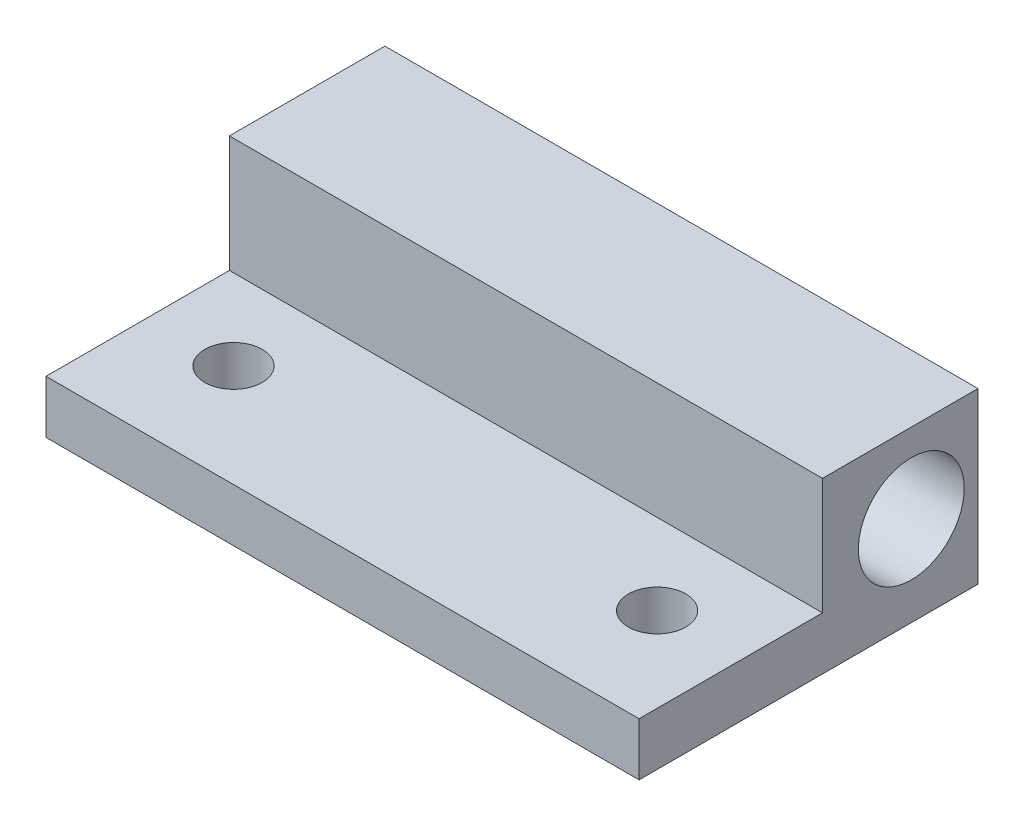
ISO-10303-21;
HEADER;
FILE_DESCRIPTION(('STEP AP214'),'2;1');
FILE_NAME('part.step','',(''),(''),'','','');
FILE_SCHEMA(('AUTOMOTIVE_DESIGN { 1 0 10303 214 1 1 1 1 }'));
ENDSEC;
DATA;
#1=APPLICATION_CONTEXT('core data for automotive mechanical design processes');
#2=APPLICATION_PROTOCOL_DEFINITION('international standard','automotive_design',2000,#1);
#3=PRODUCT_CONTEXT('',#1,'mechanical');
#4=PRODUCT('Part','Part','',(#3));
#5=PRODUCT_RELATED_PRODUCT_CATEGORY('part','',(#4));
#6=PRODUCT_DEFINITION_FORMATION('','',#4);
#7=PRODUCT_DEFINITION_CONTEXT('part definition',#1,'design');
#8=PRODUCT_DEFINITION('design','',#6,#7);
#9=PRODUCT_DEFINITION_SHAPE('','',#8);
#10=(LENGTH_UNIT() NAMED_UNIT(*) SI_UNIT(.MILLI.,.METRE.));
#11=(NAMED_UNIT(*) PLANE_ANGLE_UNIT() SI_UNIT($,.RADIAN.));
#12=(NAMED_UNIT(*) SI_UNIT($,.STERADIAN.) SOLID_ANGLE_UNIT());
#13=UNCERTAINTY_MEASURE_WITH_UNIT(LENGTH_MEASURE(1.E-05),#10,'distance_accuracy_value','');
#14=(GEOMETRIC_REPRESENTATION_CONTEXT(3) GLOBAL_UNCERTAINTY_ASSIGNED_CONTEXT((#13)) GLOBAL_UNIT_ASSIGNED_CONTEXT((#10,
#11,#12)) REPRESENTATION_CONTEXT('',''));
#15=CARTESIAN_POINT('',(0.,0.,0.));
#16=DIRECTION('',(0.,0.,1.));
#17=DIRECTION('',(1.,0.,0.));
#18=AXIS2_PLACEMENT_3D('',#15,#16,#17);
#19=CARTESIAN_POINT('',(-56.695243637364,12.7,44.9425829211284));
#20=DIRECTION('',(0.,0.,-1.));
#21=DIRECTION('',(-1.,0.,0.));
#22=AXIS2_PLACEMENT_3D('',#19,#20,#21);
#23=PLANE('',#22);
#24=DIRECTION('',(1.,0.,0.));
#25=VECTOR('',#24,1.);
#26=CARTESIAN_POINT('',(-12.245243637364,3.96875,44.9425829211284));
#27=LINE('',#26,#25);
#28=CARTESIAN_POINT('',(-56.695243637364,3.96875,44.9425829211284));
#29=VERTEX_POINT('',#28);
#30=CARTESIAN_POINT('',(-12.245243637364,3.96875,44.9425829211284));
#31=VERTEX_POINT('',#30);
#32=EDGE_CURVE('E121',#29,#31,#27,.T.);
#33=ORIENTED_EDGE('',*,*,#32,.F.);
#34=DIRECTION('',(0.,-1.,0.));
#35=VECTOR('',#34,1.);
#36=CARTESIAN_POINT('',(-56.695243637364,12.7,44.9425829211284));
#37=LINE('',#36,#35);
#38=CARTESIAN_POINT('',(-56.695243637364,0.,44.9425829211284));
#39=VERTEX_POINT('',#38);
#40=EDGE_CURVE('E11',#29,#39,#37,.T.);
#41=ORIENTED_EDGE('',*,*,#40,.T.);
#42=DIRECTION('',(1.,0.,0.));
#43=VECTOR('',#42,1.);
#44=CARTESIAN_POINT('',(-56.695243637364,0.,44.9425829211284));
#45=LINE('',#44,#43);
#46=CARTESIAN_POINT('',(-12.245243637364,0.,44.9425829211284));
#47=VERTEX_POINT('',#46);
#48=EDGE_CURVE('E98',#39,#47,#45,.T.);
#49=ORIENTED_EDGE('',*,*,#48,.T.);
#50=DIRECTION('',(0.,-1.,0.));
#51=VECTOR('',#50,1.);
#52=CARTESIAN_POINT('',(-12.245243637364,12.7,44.9425829211284));
#53=LINE('',#52,#51);
#54=EDGE_CURVE('E41',#31,#47,#53,.T.);
#55=ORIENTED_EDGE('',*,*,#54,.F.);
#56=EDGE_LOOP('',(#33,#41,#49,#55));
#57=FACE_BOUND('',#56,.T.);
#58=ADVANCED_FACE('F32',(#57),#23,.F.);
#59=CARTESIAN_POINT('',(-18.595243637364,12.7,37.2435104576501));
#60=DIRECTION('',(0.,1.,0.));
#61=DIRECTION('',(0.,0.,1.));
#62=AXIS2_PLACEMENT_3D('',#59,#60,#61);
#63=CYLINDRICAL_SURFACE('',#62,2.15264999999999);
#64=CARTESIAN_POINT('',(-18.595243637364,0.,37.2435104576501));
#65=DIRECTION('',(0.,1.,0.));
#66=DIRECTION('',(0.,0.,1.));
#67=AXIS2_PLACEMENT_3D('',#64,#65,#66);
#68=CIRCLE('',#67,2.15264999999999);
#69=CARTESIAN_POINT('',(-18.595243637364,0.,39.3961604576501));
#70=VERTEX_POINT('',#69);
#71=EDGE_CURVE('E154',#70,#70,#68,.T.);
#72=ORIENTED_EDGE('',*,*,#71,.F.);
#73=EDGE_LOOP('',(#72));
#74=FACE_BOUND('',#73,.T.);
#75=CARTESIAN_POINT('',(-18.595243637364,3.96875,37.2435104576501));
#76=DIRECTION('',(0.,1.,0.));
#77=DIRECTION('',(0.,0.,1.));
#78=AXIS2_PLACEMENT_3D('',#75,#76,#77);
#79=CIRCLE('',#78,2.15264999999999);
#80=CARTESIAN_POINT('',(-18.595243637364,3.96875,39.3961604576501));
#81=VERTEX_POINT('',#80);
#82=EDGE_CURVE('E148',#81,#81,#79,.F.);
#83=ORIENTED_EDGE('',*,*,#82,.F.);
#84=EDGE_LOOP('',(#83));
#85=FACE_BOUND('',#84,.T.);
#86=ADVANCED_FACE('F173',(#74,#85),#63,.F.);
#87=CARTESIAN_POINT('',(-50.345243637364,12.7,37.2435104576501));
#88=DIRECTION('',(0.,1.,0.));
#89=DIRECTION('',(0.,0.,1.));
#90=AXIS2_PLACEMENT_3D('',#87,#88,#89);
#91=CYLINDRICAL_SURFACE('',#90,2.15265);
#92=CARTESIAN_POINT('',(-50.345243637364,0.,37.2435104576501));
#93=DIRECTION('',(0.,1.,0.));
#94=DIRECTION('',(0.,0.,1.));
#95=AXIS2_PLACEMENT_3D('',#92,#93,#94);
#96=CIRCLE('',#95,2.15265);
#97=CARTESIAN_POINT('',(-50.345243637364,0.,39.3961604576501));
#98=VERTEX_POINT('',#97);
#99=EDGE_CURVE('E151',#98,#98,#96,.T.);
#100=ORIENTED_EDGE('',*,*,#99,.F.);
#101=EDGE_LOOP('',(#100));
#102=FACE_BOUND('',#101,.T.);
#103=CARTESIAN_POINT('',(-50.345243637364,3.96875,37.2435104576501));
#104=DIRECTION('',(0.,1.,0.));
#105=DIRECTION('',(0.,0.,1.));
#106=AXIS2_PLACEMENT_3D('',#103,#104,#105);
#107=CIRCLE('',#106,2.15265);
#108=CARTESIAN_POINT('',(-50.345243637364,3.96875,39.3961604576501));
#109=VERTEX_POINT('',#108);
#110=EDGE_CURVE('E36',#109,#109,#107,.F.);
#111=ORIENTED_EDGE('',*,*,#110,.F.);
#112=EDGE_LOOP('',(#111));
#113=FACE_BOUND('',#112,.T.);
#114=ADVANCED_FACE('F177',(#102,#113),#91,.F.);
#115=CARTESIAN_POINT('',(-56.695243637364,12.7,19.5425829211284));
#116=DIRECTION('',(1.,0.,0.));
#117=DIRECTION('',(0.,0.,-1.));
#118=AXIS2_PLACEMENT_3D('',#115,#116,#117);
#119=PLANE('',#118);
#120=CARTESIAN_POINT('',(-56.695243637364,6.746875,24.5435104576501));
#121=DIRECTION('',(1.,0.,0.));
#122=DIRECTION('',(0.,0.,-1.));
#123=AXIS2_PLACEMENT_3D('',#120,#121,#122);
#124=CIRCLE('',#123,3.96875);
#125=CARTESIAN_POINT('',(-56.695243637364,6.746875,20.5747604576501));
#126=VERTEX_POINT('',#125);
#127=EDGE_CURVE('E99',#126,#126,#124,.F.);
#128=ORIENTED_EDGE('',*,*,#127,.F.);
#129=EDGE_LOOP('',(#128));
#130=FACE_BOUND('',#129,.T.);
#131=DIRECTION('',(0.,0.,1.));
#132=VECTOR('',#131,1.);
#133=CARTESIAN_POINT('',(-56.695243637364,3.96875,44.9425829211284));
#134=LINE('',#133,#132);
#135=CARTESIAN_POINT('',(-56.695243637364,3.96875,31.1971095114956));
#136=VERTEX_POINT('',#135);
#137=EDGE_CURVE('E124',#136,#29,#134,.T.);
#138=ORIENTED_EDGE('',*,*,#137,.F.);
#139=DIRECTION('',(0.,1.,0.));
#140=VECTOR('',#139,1.);
#141=CARTESIAN_POINT('',(-56.695243637364,3.96875,31.1971095114956));
#142=LINE('',#141,#140);
#143=CARTESIAN_POINT('',(-56.695243637364,12.7,31.1971095114956));
#144=VERTEX_POINT('',#143);
#145=EDGE_CURVE('E137',#136,#144,#142,.T.);
#146=ORIENTED_EDGE('',*,*,#145,.T.);
#147=DIRECTION('',(0.,0.,1.));
#148=VECTOR('',#147,1.);
#149=CARTESIAN_POINT('',(-56.695243637364,12.7,19.5425829211284));
#150=LINE('',#149,#148);
#151=CARTESIAN_POINT('',(-56.695243637364,12.7,19.5425829211284));
#152=VERTEX_POINT('',#151);
#153=EDGE_CURVE('E85',#152,#144,#150,.T.);
#154=ORIENTED_EDGE('',*,*,#153,.F.);
#155=DIRECTION('',(0.,-1.,0.));
#156=VECTOR('',#155,1.);
#157=CARTESIAN_POINT('',(-56.695243637364,12.7,19.5425829211284));
#158=LINE('',#157,#156);
#159=CARTESIAN_POINT('',(-56.695243637364,0.,19.5425829211284));
#160=VERTEX_POINT('',#159);
#161=EDGE_CURVE('E78',#152,#160,#158,.T.);
#162=ORIENTED_EDGE('',*,*,#161,.T.);
#163=DIRECTION('',(0.,0.,1.));
#164=VECTOR('',#163,1.);
#165=CARTESIAN_POINT('',(-56.695243637364,0.,19.5425829211284));
#166=LINE('',#165,#164);
#167=EDGE_CURVE('E92',#160,#39,#166,.T.);
#168=ORIENTED_EDGE('',*,*,#167,.T.);
#169=ORIENTED_EDGE('',*,*,#40,.F.);
#170=EDGE_LOOP('',(#138,#146,#154,#162,#168,#169));
#171=FACE_BOUND('',#170,.T.);
#172=ADVANCED_FACE('F34',(#130,#171),#119,.F.);
#173=CARTESIAN_POINT('',(-12.245243637364,12.7,19.5425829211284));
#174=DIRECTION('',(-1.,0.,0.));
#175=DIRECTION('',(0.,0.,1.));
#176=AXIS2_PLACEMENT_3D('',#173,#174,#175);
#177=PLANE('',#176);
#178=CARTESIAN_POINT('',(-12.245243637364,6.746875,24.5435104576501));
#179=DIRECTION('',(1.,0.,0.));
#180=DIRECTION('',(0.,0.,-1.));
#181=AXIS2_PLACEMENT_3D('',#178,#179,#180);
#182=CIRCLE('',#181,3.96875);
#183=CARTESIAN_POINT('',(-12.245243637364,6.746875,20.5747604576501));
#184=VERTEX_POINT('',#183);
#185=EDGE_CURVE('E103',#184,#184,#182,.T.);
#186=ORIENTED_EDGE('',*,*,#185,.F.);
#187=EDGE_LOOP('',(#186));
#188=FACE_BOUND('',#187,.T.);
#189=DIRECTION('',(0.,0.,-1.));
#190=VECTOR('',#189,1.);
#191=CARTESIAN_POINT('',(-12.245243637364,12.7,19.5425829211284));
#192=LINE('',#191,#190);
#193=CARTESIAN_POINT('',(-12.245243637364,12.7,31.1971095114956));
#194=VERTEX_POINT('',#193);
#195=CARTESIAN_POINT('',(-12.245243637364,12.7,19.5425829211284));
#196=VERTEX_POINT('',#195);
#197=EDGE_CURVE('E142',#194,#196,#192,.T.);
#198=ORIENTED_EDGE('',*,*,#197,.F.);
#199=DIRECTION('',(0.,1.,0.));
#200=VECTOR('',#199,1.);
#201=CARTESIAN_POINT('',(-12.245243637364,3.96875,31.1971095114956));
#202=LINE('',#201,#200);
#203=CARTESIAN_POINT('',(-12.245243637364,3.96875,31.1971095114956));
#204=VERTEX_POINT('',#203);
#205=EDGE_CURVE('E48',#204,#194,#202,.T.);
#206=ORIENTED_EDGE('',*,*,#205,.F.);
#207=DIRECTION('',(0.,0.,-1.));
#208=VECTOR('',#207,1.);
#209=CARTESIAN_POINT('',(-12.245243637364,3.96875,44.9425829211284));
#210=LINE('',#209,#208);
#211=EDGE_CURVE('E116',#31,#204,#210,.T.);
#212=ORIENTED_EDGE('',*,*,#211,.F.);
#213=ORIENTED_EDGE('',*,*,#54,.T.);
#214=DIRECTION('',(0.,0.,-1.));
#215=VECTOR('',#214,1.);
#216=CARTESIAN_POINT('',(-12.245243637364,0.,19.5425829211284));
#217=LINE('',#216,#215);
#218=CARTESIAN_POINT('',(-12.245243637364,0.,19.5425829211284));
#219=VERTEX_POINT('',#218);
#220=EDGE_CURVE('E86',#47,#219,#217,.T.);
#221=ORIENTED_EDGE('',*,*,#220,.T.);
#222=DIRECTION('',(0.,-1.,0.));
#223=VECTOR('',#222,1.);
#224=CARTESIAN_POINT('',(-12.245243637364,12.7,19.5425829211284));
#225=LINE('',#224,#223);
#226=EDGE_CURVE('E81',#196,#219,#225,.T.);
#227=ORIENTED_EDGE('',*,*,#226,.F.);
#228=EDGE_LOOP('',(#198,#206,#212,#213,#221,#227));
#229=FACE_BOUND('',#228,.T.);
#230=ADVANCED_FACE('F114',(#188,#229),#177,.F.);
#231=CARTESIAN_POINT('',(-56.695243637364,12.7,19.5425829211284));
#232=DIRECTION('',(0.,0.,1.));
#233=DIRECTION('',(1.,0.,0.));
#234=AXIS2_PLACEMENT_3D('',#231,#232,#233);
#235=PLANE('',#234);
#236=DIRECTION('',(-1.,0.,0.));
#237=VECTOR('',#236,1.);
#238=CARTESIAN_POINT('',(-56.695243637364,0.,19.5425829211284));
#239=LINE('',#238,#237);
#240=EDGE_CURVE('E75',#219,#160,#239,.T.);
#241=ORIENTED_EDGE('',*,*,#240,.T.);
#242=ORIENTED_EDGE('',*,*,#161,.F.);
#243=DIRECTION('',(-1.,0.,0.));
#244=VECTOR('',#243,1.);
#245=CARTESIAN_POINT('',(-56.695243637364,12.7,19.5425829211284));
#246=LINE('',#245,#244);
#247=EDGE_CURVE('E57',#196,#152,#246,.T.);
#248=ORIENTED_EDGE('',*,*,#247,.F.);
#249=ORIENTED_EDGE('',*,*,#226,.T.);
#250=EDGE_LOOP('',(#241,#242,#248,#249));
#251=FACE_BOUND('',#250,.T.);
#252=ADVANCED_FACE('F77',(#251),#235,.F.);
#253=CARTESIAN_POINT('',(-56.695243637364,12.7,44.9425829211284));
#254=DIRECTION('',(0.,1.,0.));
#255=DIRECTION('',(0.,0.,1.));
#256=AXIS2_PLACEMENT_3D('',#253,#254,#255);
#257=PLANE('',#256);
#258=DIRECTION('',(-1.,0.,0.));
#259=VECTOR('',#258,1.);
#260=CARTESIAN_POINT('',(-12.245243637364,12.7,31.1971095114956));
#261=LINE('',#260,#259);
#262=EDGE_CURVE('E134',#194,#144,#261,.T.);
#263=ORIENTED_EDGE('',*,*,#262,.F.);
#264=ORIENTED_EDGE('',*,*,#197,.T.);
#265=ORIENTED_EDGE('',*,*,#247,.T.);
#266=ORIENTED_EDGE('',*,*,#153,.T.);
#267=EDGE_LOOP('',(#263,#264,#265,#266));
#268=FACE_BOUND('',#267,.T.);
#269=ADVANCED_FACE('F159',(#268),#257,.T.);
#270=CARTESIAN_POINT('',(-56.695243637364,0.,44.9425829211284));
#271=DIRECTION('',(0.,1.,0.));
#272=DIRECTION('',(0.,0.,1.));
#273=AXIS2_PLACEMENT_3D('',#270,#271,#272);
#274=PLANE('',#273);
#275=ORIENTED_EDGE('',*,*,#99,.T.);
#276=EDGE_LOOP('',(#275));
#277=FACE_BOUND('',#276,.T.);
#278=ORIENTED_EDGE('',*,*,#71,.T.);
#279=EDGE_LOOP('',(#278));
#280=FACE_BOUND('',#279,.T.);
#281=ORIENTED_EDGE('',*,*,#167,.F.);
#282=ORIENTED_EDGE('',*,*,#240,.F.);
#283=ORIENTED_EDGE('',*,*,#220,.F.);
#284=ORIENTED_EDGE('',*,*,#48,.F.);
#285=EDGE_LOOP('',(#281,#282,#283,#284));
#286=FACE_BOUND('',#285,.T.);
#287=ADVANCED_FACE('F96',(#277,#280,#286),#274,.F.);
#288=CARTESIAN_POINT('',(-56.696243637364,6.746875,24.5435104576501));
#289=DIRECTION('',(1.,0.,0.));
#290=DIRECTION('',(0.,0.,-1.));
#291=AXIS2_PLACEMENT_3D('',#288,#289,#290);
#292=CYLINDRICAL_SURFACE('',#291,3.96875);
#293=ORIENTED_EDGE('',*,*,#185,.T.);
#294=EDGE_LOOP('',(#293));
#295=FACE_BOUND('',#294,.T.);
#296=ORIENTED_EDGE('',*,*,#127,.T.);
#297=EDGE_LOOP('',(#296));
#298=FACE_BOUND('',#297,.T.);
#299=ADVANCED_FACE('F167',(#295,#298),#292,.F.);
#300=CARTESIAN_POINT('',(-12.245243637364,3.96875,31.1971095114956));
#301=DIRECTION('',(0.,1.,0.));
#302=DIRECTION('',(0.,0.,1.));
#303=AXIS2_PLACEMENT_3D('',#300,#301,#302);
#304=PLANE('',#303);
#305=ORIENTED_EDGE('',*,*,#110,.T.);
#306=EDGE_LOOP('',(#305));
#307=FACE_BOUND('',#306,.T.);
#308=ORIENTED_EDGE('',*,*,#211,.T.);
#309=DIRECTION('',(-1.,0.,0.));
#310=VECTOR('',#309,1.);
#311=CARTESIAN_POINT('',(-12.245243637364,3.96875,31.1971095114956));
#312=LINE('',#311,#310);
#313=EDGE_CURVE('E135',#204,#136,#312,.T.);
#314=ORIENTED_EDGE('',*,*,#313,.T.);
#315=ORIENTED_EDGE('',*,*,#137,.T.);
#316=ORIENTED_EDGE('',*,*,#32,.T.);
#317=EDGE_LOOP('',(#308,#314,#315,#316));
#318=FACE_BOUND('',#317,.T.);
#319=ORIENTED_EDGE('',*,*,#82,.T.);
#320=EDGE_LOOP('',(#319));
#321=FACE_BOUND('',#320,.T.);
#322=ADVANCED_FACE('F139',(#307,#318,#321),#304,.T.);
#323=CARTESIAN_POINT('',(-12.245243637364,3.96875,31.1971095114956));
#324=DIRECTION('',(0.,0.,-1.));
#325=DIRECTION('',(-1.,0.,0.));
#326=AXIS2_PLACEMENT_3D('',#323,#324,#325);
#327=PLANE('',#326);
#328=ORIENTED_EDGE('',*,*,#262,.T.);
#329=ORIENTED_EDGE('',*,*,#145,.F.);
#330=ORIENTED_EDGE('',*,*,#313,.F.);
#331=ORIENTED_EDGE('',*,*,#205,.T.);
#332=EDGE_LOOP('',(#328,#329,#330,#331));
#333=FACE_BOUND('',#332,.T.);
#334=ADVANCED_FACE('F136',(#333),#327,.F.);
#335=CLOSED_SHELL('',(#58,#86,#114,#172,#230,#252,#269,#287,#299,#322,#334));
#336=MANIFOLD_SOLID_BREP('B2',#335);
#337=ADVANCED_BREP_SHAPE_REPRESENTATION('',(#18,#336),#14);
#338=SHAPE_DEFINITION_REPRESENTATION(#9,#337);
ENDSEC;
END-ISO-10303-21;
